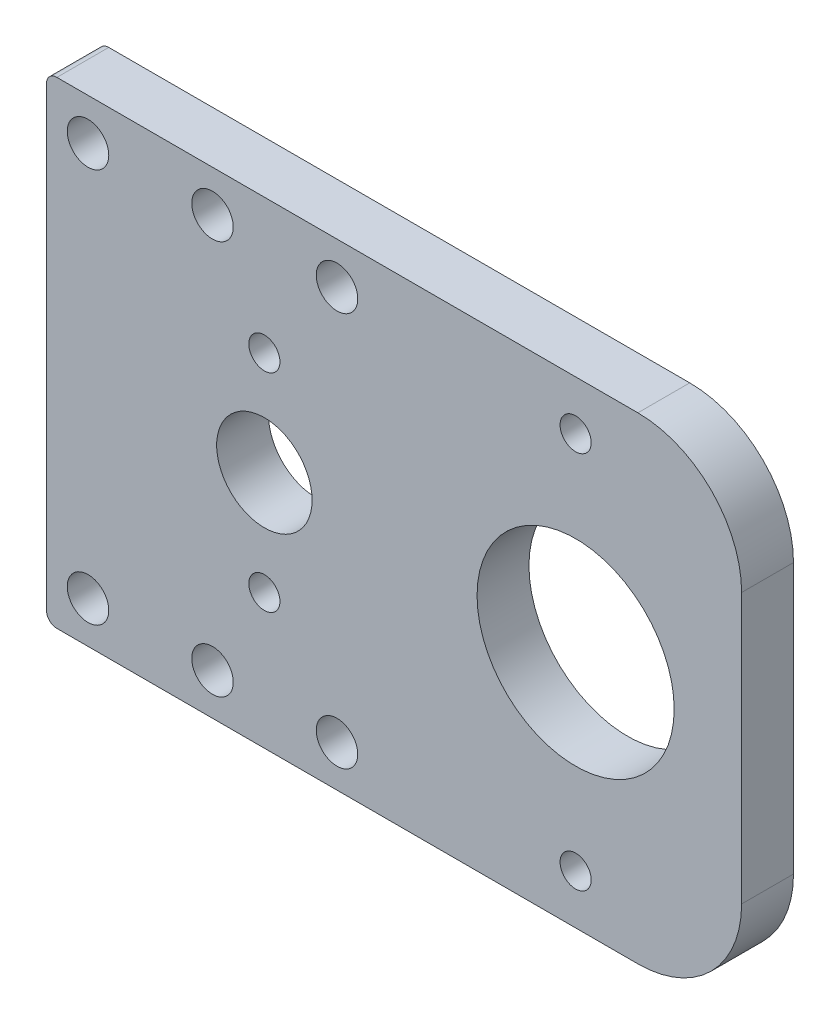
ISO-10303-21;
HEADER;
FILE_DESCRIPTION(('STEP AP214'),'2;1');
FILE_NAME('part.step','',(''),(''),'','','');
FILE_SCHEMA(('AUTOMOTIVE_DESIGN { 1 0 10303 214 1 1 1 1 }'));
ENDSEC;
DATA;
#1=APPLICATION_CONTEXT('core data for automotive mechanical design processes');
#2=APPLICATION_PROTOCOL_DEFINITION('international standard','automotive_design',2000,#1);
#3=PRODUCT_CONTEXT('',#1,'mechanical');
#4=PRODUCT('Part','Part','',(#3));
#5=PRODUCT_RELATED_PRODUCT_CATEGORY('part','',(#4));
#6=PRODUCT_DEFINITION_FORMATION('','',#4);
#7=PRODUCT_DEFINITION_CONTEXT('part definition',#1,'design');
#8=PRODUCT_DEFINITION('design','',#6,#7);
#9=PRODUCT_DEFINITION_SHAPE('','',#8);
#10=(LENGTH_UNIT() NAMED_UNIT(*) SI_UNIT(.MILLI.,.METRE.));
#11=(NAMED_UNIT(*) PLANE_ANGLE_UNIT() SI_UNIT($,.RADIAN.));
#12=(NAMED_UNIT(*) SI_UNIT($,.STERADIAN.) SOLID_ANGLE_UNIT());
#13=UNCERTAINTY_MEASURE_WITH_UNIT(LENGTH_MEASURE(1.E-05),#10,'distance_accuracy_value','');
#14=(GEOMETRIC_REPRESENTATION_CONTEXT(3) GLOBAL_UNCERTAINTY_ASSIGNED_CONTEXT((#13)) GLOBAL_UNIT_ASSIGNED_CONTEXT((#10,
#11,#12)) REPRESENTATION_CONTEXT('',''));
#15=CARTESIAN_POINT('',(0.,0.,0.));
#16=DIRECTION('',(0.,0.,1.));
#17=DIRECTION('',(1.,0.,0.));
#18=AXIS2_PLACEMENT_3D('',#15,#16,#17);
#19=CARTESIAN_POINT('',(0.,0.,5.));
#20=DIRECTION('',(0.,0.,1.));
#21=DIRECTION('',(1.,0.,0.));
#22=AXIS2_PLACEMENT_3D('',#19,#20,#21);
#23=PLANE('',#22);
#24=CARTESIAN_POINT('',(7.00000000000001,18.9999999999999,5.));
#25=DIRECTION('',(0.,0.,1.));
#26=DIRECTION('',(1.,0.,0.));
#27=AXIS2_PLACEMENT_3D('',#24,#25,#26);
#28=CIRCLE('',#27,2.);
#29=CARTESIAN_POINT('',(9.00000000000001,18.9999999999999,5.));
#30=VERTEX_POINT('',#29);
#31=EDGE_CURVE('E181',#30,#30,#28,.F.);
#32=ORIENTED_EDGE('',*,*,#31,.T.);
#33=EDGE_LOOP('',(#32));
#34=FACE_BOUND('',#33,.T.);
#35=CARTESIAN_POINT('',(-4.99999999999999,-18.9999999999999,5.));
#36=DIRECTION('',(0.,0.,1.));
#37=DIRECTION('',(1.,0.,0.));
#38=AXIS2_PLACEMENT_3D('',#35,#36,#37);
#39=CIRCLE('',#38,2.);
#40=CARTESIAN_POINT('',(-2.99999999999999,-18.9999999999999,5.));
#41=VERTEX_POINT('',#40);
#42=EDGE_CURVE('E174',#41,#41,#39,.F.);
#43=ORIENTED_EDGE('',*,*,#42,.T.);
#44=EDGE_LOOP('',(#43));
#45=FACE_BOUND('',#44,.T.);
#46=CARTESIAN_POINT('',(-17.,-18.9999999999999,5.));
#47=DIRECTION('',(0.,0.,1.));
#48=DIRECTION('',(1.,0.,0.));
#49=AXIS2_PLACEMENT_3D('',#46,#47,#48);
#50=CIRCLE('',#49,2.);
#51=CARTESIAN_POINT('',(-15.,-18.9999999999999,5.));
#52=VERTEX_POINT('',#51);
#53=EDGE_CURVE('E177',#52,#52,#50,.F.);
#54=ORIENTED_EDGE('',*,*,#53,.T.);
#55=EDGE_LOOP('',(#54));
#56=FACE_BOUND('',#55,.T.);
#57=CARTESIAN_POINT('',(30.,18.25,5.));
#58=DIRECTION('',(0.,0.,1.));
#59=DIRECTION('',(1.,0.,0.));
#60=AXIS2_PLACEMENT_3D('',#57,#58,#59);
#61=CIRCLE('',#60,1.5);
#62=CARTESIAN_POINT('',(31.5,18.25,5.));
#63=VERTEX_POINT('',#62);
#64=EDGE_CURVE('E192',#63,#63,#61,.T.);
#65=ORIENTED_EDGE('',*,*,#64,.F.);
#66=EDGE_LOOP('',(#65));
#67=FACE_BOUND('',#66,.T.);
#68=CARTESIAN_POINT('',(0.,-9.99999999999999,5.));
#69=DIRECTION('',(0.,0.,1.));
#70=DIRECTION('',(1.,0.,0.));
#71=AXIS2_PLACEMENT_3D('',#68,#69,#70);
#72=CIRCLE('',#71,1.5);
#73=CARTESIAN_POINT('',(1.50000000000002,-9.99999999999999,5.));
#74=VERTEX_POINT('',#73);
#75=EDGE_CURVE('E195',#74,#74,#72,.T.);
#76=ORIENTED_EDGE('',*,*,#75,.F.);
#77=EDGE_LOOP('',(#76));
#78=FACE_BOUND('',#77,.T.);
#79=CARTESIAN_POINT('',(30.,-18.25,5.));
#80=DIRECTION('',(0.,0.,1.));
#81=DIRECTION('',(1.,0.,0.));
#82=AXIS2_PLACEMENT_3D('',#79,#80,#81);
#83=CIRCLE('',#82,1.5);
#84=CARTESIAN_POINT('',(31.5,-18.25,5.));
#85=VERTEX_POINT('',#84);
#86=EDGE_CURVE('E199',#85,#85,#83,.F.);
#87=ORIENTED_EDGE('',*,*,#86,.T.);
#88=EDGE_LOOP('',(#87));
#89=FACE_BOUND('',#88,.T.);
#90=CARTESIAN_POINT('',(30.,0.,5.));
#91=DIRECTION('',(0.,0.,1.));
#92=DIRECTION('',(1.,0.,0.));
#93=AXIS2_PLACEMENT_3D('',#90,#91,#92);
#94=CIRCLE('',#93,9.5);
#95=CARTESIAN_POINT('',(39.5,0.,5.));
#96=VERTEX_POINT('',#95);
#97=EDGE_CURVE('E202',#96,#96,#94,.T.);
#98=ORIENTED_EDGE('',*,*,#97,.F.);
#99=EDGE_LOOP('',(#98));
#100=FACE_BOUND('',#99,.T.);
#101=CARTESIAN_POINT('',(0.,0.,5.));
#102=DIRECTION('',(0.,0.,1.));
#103=DIRECTION('',(1.,0.,0.));
#104=AXIS2_PLACEMENT_3D('',#101,#102,#103);
#105=CIRCLE('',#104,4.6);
#106=CARTESIAN_POINT('',(4.6,0.,5.));
#107=VERTEX_POINT('',#106);
#108=EDGE_CURVE('E208',#107,#107,#105,.T.);
#109=ORIENTED_EDGE('',*,*,#108,.F.);
#110=EDGE_LOOP('',(#109));
#111=FACE_BOUND('',#110,.T.);
#112=CARTESIAN_POINT('',(0.,9.99999999999999,5.));
#113=DIRECTION('',(0.,0.,1.));
#114=DIRECTION('',(1.,0.,0.));
#115=AXIS2_PLACEMENT_3D('',#112,#113,#114);
#116=CIRCLE('',#115,1.5);
#117=CARTESIAN_POINT('',(1.50000000000002,9.99999999999999,5.));
#118=VERTEX_POINT('',#117);
#119=EDGE_CURVE('E113',#118,#118,#116,.F.);
#120=ORIENTED_EDGE('',*,*,#119,.T.);
#121=EDGE_LOOP('',(#120));
#122=FACE_BOUND('',#121,.T.);
#123=CARTESIAN_POINT('',(7.00000000000001,-18.9999999999999,5.));
#124=DIRECTION('',(0.,0.,1.));
#125=DIRECTION('',(1.,0.,0.));
#126=AXIS2_PLACEMENT_3D('',#123,#124,#125);
#127=CIRCLE('',#126,2.);
#128=CARTESIAN_POINT('',(9.00000000000001,-18.9999999999999,5.));
#129=VERTEX_POINT('',#128);
#130=EDGE_CURVE('E178',#129,#129,#127,.T.);
#131=ORIENTED_EDGE('',*,*,#130,.F.);
#132=EDGE_LOOP('',(#131));
#133=FACE_BOUND('',#132,.T.);
#134=CARTESIAN_POINT('',(-4.99999999999999,18.9999999999999,5.));
#135=DIRECTION('',(0.,0.,1.));
#136=DIRECTION('',(1.,0.,0.));
#137=AXIS2_PLACEMENT_3D('',#134,#135,#136);
#138=CIRCLE('',#137,2.);
#139=CARTESIAN_POINT('',(-2.99999999999999,18.9999999999999,5.));
#140=VERTEX_POINT('',#139);
#141=EDGE_CURVE('E184',#140,#140,#138,.T.);
#142=ORIENTED_EDGE('',*,*,#141,.F.);
#143=EDGE_LOOP('',(#142));
#144=FACE_BOUND('',#143,.T.);
#145=CARTESIAN_POINT('',(-17.,18.9999999999999,5.));
#146=DIRECTION('',(0.,0.,1.));
#147=DIRECTION('',(1.,0.,0.));
#148=AXIS2_PLACEMENT_3D('',#145,#146,#147);
#149=CIRCLE('',#148,2.);
#150=CARTESIAN_POINT('',(-15.,18.9999999999999,5.));
#151=VERTEX_POINT('',#150);
#152=EDGE_CURVE('E170',#151,#151,#149,.T.);
#153=ORIENTED_EDGE('',*,*,#152,.F.);
#154=EDGE_LOOP('',(#153));
#155=FACE_BOUND('',#154,.T.);
#156=DIRECTION('',(-1.,0.,0.));
#157=VECTOR('',#156,1.);
#158=CARTESIAN_POINT('',(0.,23.,5.));
#159=LINE('',#158,#157);
#160=CARTESIAN_POINT('',(36.,23.,5.));
#161=VERTEX_POINT('',#160);
#162=CARTESIAN_POINT('',(-20.,23.,5.));
#163=VERTEX_POINT('',#162);
#164=EDGE_CURVE('E165',#161,#163,#159,.T.);
#165=ORIENTED_EDGE('',*,*,#164,.T.);
#166=CARTESIAN_POINT('',(-20.,22.,5.));
#167=DIRECTION('',(0.,0.,1.));
#168=DIRECTION('',(1.,0.,0.));
#169=AXIS2_PLACEMENT_3D('',#166,#167,#168);
#170=CIRCLE('',#169,1.);
#171=CARTESIAN_POINT('',(-21.,22.,5.));
#172=VERTEX_POINT('',#171);
#173=EDGE_CURVE('E139',#163,#172,#170,.T.);
#174=ORIENTED_EDGE('',*,*,#173,.T.);
#175=DIRECTION('',(0.,-1.,0.));
#176=VECTOR('',#175,1.);
#177=CARTESIAN_POINT('',(-21.,0.,5.));
#178=LINE('',#177,#176);
#179=CARTESIAN_POINT('',(-21.,-22.,5.));
#180=VERTEX_POINT('',#179);
#181=EDGE_CURVE('E120',#172,#180,#178,.T.);
#182=ORIENTED_EDGE('',*,*,#181,.T.);
#183=CARTESIAN_POINT('',(-20.,-22.,5.));
#184=DIRECTION('',(0.,0.,1.));
#185=DIRECTION('',(1.,0.,0.));
#186=AXIS2_PLACEMENT_3D('',#183,#184,#185);
#187=CIRCLE('',#186,1.);
#188=CARTESIAN_POINT('',(-20.,-23.,5.));
#189=VERTEX_POINT('',#188);
#190=EDGE_CURVE('E137',#180,#189,#187,.T.);
#191=ORIENTED_EDGE('',*,*,#190,.T.);
#192=DIRECTION('',(-1.,0.,0.));
#193=VECTOR('',#192,1.);
#194=CARTESIAN_POINT('',(0.,-23.,5.));
#195=LINE('',#194,#193);
#196=CARTESIAN_POINT('',(36.,-23.,5.));
#197=VERTEX_POINT('',#196);
#198=EDGE_CURVE('E206',#197,#189,#195,.T.);
#199=ORIENTED_EDGE('',*,*,#198,.F.);
#200=CARTESIAN_POINT('',(36.,-13.,5.));
#201=DIRECTION('',(0.,0.,1.));
#202=DIRECTION('',(1.,0.,0.));
#203=AXIS2_PLACEMENT_3D('',#200,#201,#202);
#204=CIRCLE('',#203,10.);
#205=CARTESIAN_POINT('',(46.,-13.,5.));
#206=VERTEX_POINT('',#205);
#207=EDGE_CURVE('E248',#197,#206,#204,.T.);
#208=ORIENTED_EDGE('',*,*,#207,.T.);
#209=DIRECTION('',(0.,-1.,0.));
#210=VECTOR('',#209,1.);
#211=CARTESIAN_POINT('',(46.,0.,5.));
#212=LINE('',#211,#210);
#213=CARTESIAN_POINT('',(46.,13.,5.));
#214=VERTEX_POINT('',#213);
#215=EDGE_CURVE('E109',#214,#206,#212,.T.);
#216=ORIENTED_EDGE('',*,*,#215,.F.);
#217=CARTESIAN_POINT('',(36.,13.,5.));
#218=DIRECTION('',(0.,0.,1.));
#219=DIRECTION('',(1.,0.,0.));
#220=AXIS2_PLACEMENT_3D('',#217,#218,#219);
#221=CIRCLE('',#220,10.);
#222=EDGE_CURVE('E129',#214,#161,#221,.T.);
#223=ORIENTED_EDGE('',*,*,#222,.T.);
#224=EDGE_LOOP('',(#165,#174,#182,#191,#199,#208,#216,#223));
#225=FACE_BOUND('',#224,.T.);
#226=ADVANCED_FACE('F35',(#34,#45,#56,#67,#78,#89,#100,#111,#122,#133,#144,#155,#225),#23,.T.);
#227=CARTESIAN_POINT('',(0.,0.,0.));
#228=DIRECTION('',(0.,0.,1.));
#229=DIRECTION('',(1.,0.,0.));
#230=AXIS2_PLACEMENT_3D('',#227,#228,#229);
#231=PLANE('',#230);
#232=CARTESIAN_POINT('',(-17.,18.9999999999999,0.));
#233=DIRECTION('',(0.,0.,1.));
#234=DIRECTION('',(1.,0.,0.));
#235=AXIS2_PLACEMENT_3D('',#232,#233,#234);
#236=CIRCLE('',#235,2.);
#237=CARTESIAN_POINT('',(-15.,18.9999999999999,0.));
#238=VERTEX_POINT('',#237);
#239=EDGE_CURVE('E217',#238,#238,#236,.T.);
#240=ORIENTED_EDGE('',*,*,#239,.T.);
#241=EDGE_LOOP('',(#240));
#242=FACE_BOUND('',#241,.T.);
#243=CARTESIAN_POINT('',(7.00000000000001,-18.9999999999999,0.));
#244=DIRECTION('',(0.,0.,1.));
#245=DIRECTION('',(1.,0.,0.));
#246=AXIS2_PLACEMENT_3D('',#243,#244,#245);
#247=CIRCLE('',#246,2.);
#248=CARTESIAN_POINT('',(9.00000000000001,-18.9999999999999,0.));
#249=VERTEX_POINT('',#248);
#250=EDGE_CURVE('E236',#249,#249,#247,.T.);
#251=ORIENTED_EDGE('',*,*,#250,.T.);
#252=EDGE_LOOP('',(#251));
#253=FACE_BOUND('',#252,.T.);
#254=CARTESIAN_POINT('',(-4.99999999999999,-18.9999999999999,0.));
#255=DIRECTION('',(0.,0.,1.));
#256=DIRECTION('',(1.,0.,0.));
#257=AXIS2_PLACEMENT_3D('',#254,#255,#256);
#258=CIRCLE('',#257,2.);
#259=CARTESIAN_POINT('',(-2.99999999999999,-18.9999999999999,0.));
#260=VERTEX_POINT('',#259);
#261=EDGE_CURVE('E233',#260,#260,#258,.F.);
#262=ORIENTED_EDGE('',*,*,#261,.F.);
#263=EDGE_LOOP('',(#262));
#264=FACE_BOUND('',#263,.T.);
#265=CARTESIAN_POINT('',(-17.,-18.9999999999999,0.));
#266=DIRECTION('',(0.,0.,1.));
#267=DIRECTION('',(1.,0.,0.));
#268=AXIS2_PLACEMENT_3D('',#265,#266,#267);
#269=CIRCLE('',#268,2.);
#270=CARTESIAN_POINT('',(-15.,-18.9999999999999,0.));
#271=VERTEX_POINT('',#270);
#272=EDGE_CURVE('E191',#271,#271,#269,.F.);
#273=ORIENTED_EDGE('',*,*,#272,.F.);
#274=EDGE_LOOP('',(#273));
#275=FACE_BOUND('',#274,.T.);
#276=CARTESIAN_POINT('',(30.,18.25,0.));
#277=DIRECTION('',(0.,0.,1.));
#278=DIRECTION('',(1.,0.,0.));
#279=AXIS2_PLACEMENT_3D('',#276,#277,#278);
#280=CIRCLE('',#279,1.5);
#281=CARTESIAN_POINT('',(31.5,18.25,0.));
#282=VERTEX_POINT('',#281);
#283=EDGE_CURVE('E213',#282,#282,#280,.T.);
#284=ORIENTED_EDGE('',*,*,#283,.T.);
#285=EDGE_LOOP('',(#284));
#286=FACE_BOUND('',#285,.T.);
#287=CARTESIAN_POINT('',(0.,-9.99999999999999,0.));
#288=DIRECTION('',(0.,0.,1.));
#289=DIRECTION('',(1.,0.,0.));
#290=AXIS2_PLACEMENT_3D('',#287,#288,#289);
#291=CIRCLE('',#290,1.5);
#292=CARTESIAN_POINT('',(1.50000000000002,-9.99999999999999,0.));
#293=VERTEX_POINT('',#292);
#294=EDGE_CURVE('E216',#293,#293,#291,.T.);
#295=ORIENTED_EDGE('',*,*,#294,.T.);
#296=EDGE_LOOP('',(#295));
#297=FACE_BOUND('',#296,.T.);
#298=CARTESIAN_POINT('',(30.,-18.25,0.));
#299=DIRECTION('',(0.,0.,1.));
#300=DIRECTION('',(1.,0.,0.));
#301=AXIS2_PLACEMENT_3D('',#298,#299,#300);
#302=CIRCLE('',#301,1.5);
#303=CARTESIAN_POINT('',(31.5,-18.25,0.));
#304=VERTEX_POINT('',#303);
#305=EDGE_CURVE('E220',#304,#304,#302,.F.);
#306=ORIENTED_EDGE('',*,*,#305,.F.);
#307=EDGE_LOOP('',(#306));
#308=FACE_BOUND('',#307,.T.);
#309=CARTESIAN_POINT('',(30.,0.,0.));
#310=DIRECTION('',(0.,0.,1.));
#311=DIRECTION('',(1.,0.,0.));
#312=AXIS2_PLACEMENT_3D('',#309,#310,#311);
#313=CIRCLE('',#312,9.5);
#314=CARTESIAN_POINT('',(39.5,0.,0.));
#315=VERTEX_POINT('',#314);
#316=EDGE_CURVE('E159',#315,#315,#313,.T.);
#317=ORIENTED_EDGE('',*,*,#316,.T.);
#318=EDGE_LOOP('',(#317));
#319=FACE_BOUND('',#318,.T.);
#320=CARTESIAN_POINT('',(0.,0.,0.));
#321=DIRECTION('',(0.,0.,1.));
#322=DIRECTION('',(1.,0.,0.));
#323=AXIS2_PLACEMENT_3D('',#320,#321,#322);
#324=CIRCLE('',#323,4.6);
#325=CARTESIAN_POINT('',(4.6,0.,0.));
#326=VERTEX_POINT('',#325);
#327=EDGE_CURVE('E226',#326,#326,#324,.T.);
#328=ORIENTED_EDGE('',*,*,#327,.T.);
#329=EDGE_LOOP('',(#328));
#330=FACE_BOUND('',#329,.T.);
#331=CARTESIAN_POINT('',(0.,9.99999999999999,0.));
#332=DIRECTION('',(0.,0.,1.));
#333=DIRECTION('',(1.,0.,0.));
#334=AXIS2_PLACEMENT_3D('',#331,#332,#333);
#335=CIRCLE('',#334,1.5);
#336=CARTESIAN_POINT('',(1.50000000000002,9.99999999999999,0.));
#337=VERTEX_POINT('',#336);
#338=EDGE_CURVE('E196',#337,#337,#335,.F.);
#339=ORIENTED_EDGE('',*,*,#338,.F.);
#340=EDGE_LOOP('',(#339));
#341=FACE_BOUND('',#340,.T.);
#342=CARTESIAN_POINT('',(7.00000000000001,18.9999999999999,0.));
#343=DIRECTION('',(0.,0.,1.));
#344=DIRECTION('',(1.,0.,0.));
#345=AXIS2_PLACEMENT_3D('',#342,#343,#344);
#346=CIRCLE('',#345,2.);
#347=CARTESIAN_POINT('',(9.00000000000001,18.9999999999999,0.));
#348=VERTEX_POINT('',#347);
#349=EDGE_CURVE('E239',#348,#348,#346,.F.);
#350=ORIENTED_EDGE('',*,*,#349,.F.);
#351=EDGE_LOOP('',(#350));
#352=FACE_BOUND('',#351,.T.);
#353=CARTESIAN_POINT('',(-4.99999999999999,18.9999999999999,0.));
#354=DIRECTION('',(0.,0.,1.));
#355=DIRECTION('',(1.,0.,0.));
#356=AXIS2_PLACEMENT_3D('',#353,#354,#355);
#357=CIRCLE('',#356,2.);
#358=CARTESIAN_POINT('',(-2.99999999999999,18.9999999999999,0.));
#359=VERTEX_POINT('',#358);
#360=EDGE_CURVE('E242',#359,#359,#357,.T.);
#361=ORIENTED_EDGE('',*,*,#360,.T.);
#362=EDGE_LOOP('',(#361));
#363=FACE_BOUND('',#362,.T.);
#364=DIRECTION('',(0.,-1.,0.));
#365=VECTOR('',#364,1.);
#366=CARTESIAN_POINT('',(-21.,0.,0.));
#367=LINE('',#366,#365);
#368=CARTESIAN_POINT('',(-21.,22.,0.));
#369=VERTEX_POINT('',#368);
#370=CARTESIAN_POINT('',(-21.,-22.,0.));
#371=VERTEX_POINT('',#370);
#372=EDGE_CURVE('E149',#369,#371,#367,.T.);
#373=ORIENTED_EDGE('',*,*,#372,.F.);
#374=CARTESIAN_POINT('',(-20.,22.,0.));
#375=DIRECTION('',(0.,0.,1.));
#376=DIRECTION('',(1.,0.,0.));
#377=AXIS2_PLACEMENT_3D('',#374,#375,#376);
#378=CIRCLE('',#377,1.);
#379=CARTESIAN_POINT('',(-20.,23.,0.));
#380=VERTEX_POINT('',#379);
#381=EDGE_CURVE('E43',#369,#380,#378,.F.);
#382=ORIENTED_EDGE('',*,*,#381,.T.);
#383=DIRECTION('',(-1.,0.,0.));
#384=VECTOR('',#383,1.);
#385=CARTESIAN_POINT('',(0.,23.,0.));
#386=LINE('',#385,#384);
#387=CARTESIAN_POINT('',(36.,23.,0.));
#388=VERTEX_POINT('',#387);
#389=EDGE_CURVE('E148',#388,#380,#386,.T.);
#390=ORIENTED_EDGE('',*,*,#389,.F.);
#391=CARTESIAN_POINT('',(36.,13.,0.));
#392=DIRECTION('',(0.,0.,1.));
#393=DIRECTION('',(1.,0.,0.));
#394=AXIS2_PLACEMENT_3D('',#391,#392,#393);
#395=CIRCLE('',#394,10.);
#396=CARTESIAN_POINT('',(46.,13.,0.));
#397=VERTEX_POINT('',#396);
#398=EDGE_CURVE('E119',#388,#397,#395,.F.);
#399=ORIENTED_EDGE('',*,*,#398,.T.);
#400=DIRECTION('',(0.,1.,0.));
#401=VECTOR('',#400,1.);
#402=CARTESIAN_POINT('',(46.,0.,0.));
#403=LINE('',#402,#401);
#404=CARTESIAN_POINT('',(46.,-13.,0.));
#405=VERTEX_POINT('',#404);
#406=EDGE_CURVE('E106',#405,#397,#403,.T.);
#407=ORIENTED_EDGE('',*,*,#406,.F.);
#408=CARTESIAN_POINT('',(36.,-13.,0.));
#409=DIRECTION('',(0.,0.,1.));
#410=DIRECTION('',(1.,0.,0.));
#411=AXIS2_PLACEMENT_3D('',#408,#409,#410);
#412=CIRCLE('',#411,10.);
#413=CARTESIAN_POINT('',(36.,-23.,0.));
#414=VERTEX_POINT('',#413);
#415=EDGE_CURVE('E116',#405,#414,#412,.F.);
#416=ORIENTED_EDGE('',*,*,#415,.T.);
#417=DIRECTION('',(-1.,0.,0.));
#418=VECTOR('',#417,1.);
#419=CARTESIAN_POINT('',(0.,-23.,0.));
#420=LINE('',#419,#418);
#421=CARTESIAN_POINT('',(-20.,-23.,0.));
#422=VERTEX_POINT('',#421);
#423=EDGE_CURVE('E158',#414,#422,#420,.T.);
#424=ORIENTED_EDGE('',*,*,#423,.T.);
#425=CARTESIAN_POINT('',(-20.,-22.,0.));
#426=DIRECTION('',(0.,0.,1.));
#427=DIRECTION('',(1.,0.,0.));
#428=AXIS2_PLACEMENT_3D('',#425,#426,#427);
#429=CIRCLE('',#428,1.);
#430=EDGE_CURVE('E55',#422,#371,#429,.F.);
#431=ORIENTED_EDGE('',*,*,#430,.T.);
#432=EDGE_LOOP('',(#373,#382,#390,#399,#407,#416,#424,#431));
#433=FACE_BOUND('',#432,.T.);
#434=ADVANCED_FACE('F115',(#242,#253,#264,#275,#286,#297,#308,#319,#330,#341,#352,#363,#433),
#231,.F.);
#435=CARTESIAN_POINT('',(0.,23.,5.));
#436=DIRECTION('',(0.,-1.,0.));
#437=DIRECTION('',(1.,0.,0.));
#438=AXIS2_PLACEMENT_3D('',#435,#436,#437);
#439=PLANE('',#438);
#440=ORIENTED_EDGE('',*,*,#389,.T.);
#441=DIRECTION('',(0.,0.,1.));
#442=VECTOR('',#441,1.);
#443=CARTESIAN_POINT('',(-20.,23.,5.));
#444=LINE('',#443,#442);
#445=EDGE_CURVE('E134',#380,#163,#444,.T.);
#446=ORIENTED_EDGE('',*,*,#445,.T.);
#447=ORIENTED_EDGE('',*,*,#164,.F.);
#448=DIRECTION('',(0.,0.,1.));
#449=VECTOR('',#448,1.);
#450=CARTESIAN_POINT('',(36.,23.,5.));
#451=LINE('',#450,#449);
#452=EDGE_CURVE('E126',#161,#388,#451,.F.);
#453=ORIENTED_EDGE('',*,*,#452,.T.);
#454=EDGE_LOOP('',(#440,#446,#447,#453));
#455=FACE_BOUND('',#454,.T.);
#456=ADVANCED_FACE('F154',(#455),#439,.F.);
#457=CARTESIAN_POINT('',(0.,-23.,5.));
#458=DIRECTION('',(0.,-1.,0.));
#459=DIRECTION('',(1.,0.,0.));
#460=AXIS2_PLACEMENT_3D('',#457,#458,#459);
#461=PLANE('',#460);
#462=ORIENTED_EDGE('',*,*,#198,.T.);
#463=DIRECTION('',(0.,0.,1.));
#464=VECTOR('',#463,1.);
#465=CARTESIAN_POINT('',(-20.,-23.,5.));
#466=LINE('',#465,#464);
#467=EDGE_CURVE('E11',#189,#422,#466,.F.);
#468=ORIENTED_EDGE('',*,*,#467,.T.);
#469=ORIENTED_EDGE('',*,*,#423,.F.);
#470=DIRECTION('',(0.,0.,1.));
#471=VECTOR('',#470,1.);
#472=CARTESIAN_POINT('',(36.,-23.,5.));
#473=LINE('',#472,#471);
#474=EDGE_CURVE('E125',#414,#197,#473,.T.);
#475=ORIENTED_EDGE('',*,*,#474,.T.);
#476=EDGE_LOOP('',(#462,#468,#469,#475));
#477=FACE_BOUND('',#476,.T.);
#478=ADVANCED_FACE('F282',(#477),#461,.T.);
#479=CARTESIAN_POINT('',(0.,0.,5.));
#480=DIRECTION('',(0.,0.,-1.));
#481=DIRECTION('',(-1.,0.,0.));
#482=AXIS2_PLACEMENT_3D('',#479,#480,#481);
#483=CYLINDRICAL_SURFACE('',#482,4.6);
#484=ORIENTED_EDGE('',*,*,#108,.T.);
#485=EDGE_LOOP('',(#484));
#486=FACE_BOUND('',#485,.T.);
#487=ORIENTED_EDGE('',*,*,#327,.F.);
#488=EDGE_LOOP('',(#487));
#489=FACE_BOUND('',#488,.T.);
#490=ADVANCED_FACE('F278',(#486,#489),#483,.F.);
#491=CARTESIAN_POINT('',(30.,0.,5.));
#492=DIRECTION('',(0.,0.,-1.));
#493=DIRECTION('',(-1.,0.,0.));
#494=AXIS2_PLACEMENT_3D('',#491,#492,#493);
#495=CYLINDRICAL_SURFACE('',#494,9.5);
#496=ORIENTED_EDGE('',*,*,#97,.T.);
#497=EDGE_LOOP('',(#496));
#498=FACE_BOUND('',#497,.T.);
#499=ORIENTED_EDGE('',*,*,#316,.F.);
#500=EDGE_LOOP('',(#499));
#501=FACE_BOUND('',#500,.T.);
#502=ADVANCED_FACE('F281',(#498,#501),#495,.F.);
#503=CARTESIAN_POINT('',(30.,-18.25,5.));
#504=DIRECTION('',(0.,0.,-1.));
#505=DIRECTION('',(-1.,0.,0.));
#506=AXIS2_PLACEMENT_3D('',#503,#504,#505);
#507=CYLINDRICAL_SURFACE('',#506,1.5);
#508=ORIENTED_EDGE('',*,*,#86,.F.);
#509=EDGE_LOOP('',(#508));
#510=FACE_BOUND('',#509,.T.);
#511=ORIENTED_EDGE('',*,*,#305,.T.);
#512=EDGE_LOOP('',(#511));
#513=FACE_BOUND('',#512,.T.);
#514=ADVANCED_FACE('F290',(#510,#513),#507,.F.);
#515=CARTESIAN_POINT('',(0.,-9.99999999999999,5.));
#516=DIRECTION('',(0.,0.,-1.));
#517=DIRECTION('',(-1.,0.,0.));
#518=AXIS2_PLACEMENT_3D('',#515,#516,#517);
#519=CYLINDRICAL_SURFACE('',#518,1.5);
#520=ORIENTED_EDGE('',*,*,#75,.T.);
#521=EDGE_LOOP('',(#520));
#522=FACE_BOUND('',#521,.T.);
#523=ORIENTED_EDGE('',*,*,#294,.F.);
#524=EDGE_LOOP('',(#523));
#525=FACE_BOUND('',#524,.T.);
#526=ADVANCED_FACE('F294',(#522,#525),#519,.F.);
#527=CARTESIAN_POINT('',(30.,18.25,5.));
#528=DIRECTION('',(0.,0.,-1.));
#529=DIRECTION('',(-1.,0.,0.));
#530=AXIS2_PLACEMENT_3D('',#527,#528,#529);
#531=CYLINDRICAL_SURFACE('',#530,1.5);
#532=ORIENTED_EDGE('',*,*,#64,.T.);
#533=EDGE_LOOP('',(#532));
#534=FACE_BOUND('',#533,.T.);
#535=ORIENTED_EDGE('',*,*,#283,.F.);
#536=EDGE_LOOP('',(#535));
#537=FACE_BOUND('',#536,.T.);
#538=ADVANCED_FACE('F276',(#534,#537),#531,.F.);
#539=CARTESIAN_POINT('',(0.,9.99999999999999,5.));
#540=DIRECTION('',(0.,0.,-1.));
#541=DIRECTION('',(-1.,0.,0.));
#542=AXIS2_PLACEMENT_3D('',#539,#540,#541);
#543=CYLINDRICAL_SURFACE('',#542,1.5);
#544=ORIENTED_EDGE('',*,*,#119,.F.);
#545=EDGE_LOOP('',(#544));
#546=FACE_BOUND('',#545,.T.);
#547=ORIENTED_EDGE('',*,*,#338,.T.);
#548=EDGE_LOOP('',(#547));
#549=FACE_BOUND('',#548,.T.);
#550=ADVANCED_FACE('F273',(#546,#549),#543,.F.);
#551=CARTESIAN_POINT('',(-17.,-18.9999999999999,-5.));
#552=DIRECTION('',(0.,0.,1.));
#553=DIRECTION('',(1.,0.,0.));
#554=AXIS2_PLACEMENT_3D('',#551,#552,#553);
#555=CYLINDRICAL_SURFACE('',#554,2.);
#556=ORIENTED_EDGE('',*,*,#53,.F.);
#557=EDGE_LOOP('',(#556));
#558=FACE_BOUND('',#557,.T.);
#559=ORIENTED_EDGE('',*,*,#272,.T.);
#560=EDGE_LOOP('',(#559));
#561=FACE_BOUND('',#560,.T.);
#562=ADVANCED_FACE('F270',(#558,#561),#555,.F.);
#563=CARTESIAN_POINT('',(-4.99999999999999,-18.9999999999999,-5.));
#564=DIRECTION('',(0.,0.,1.));
#565=DIRECTION('',(1.,0.,0.));
#566=AXIS2_PLACEMENT_3D('',#563,#564,#565);
#567=CYLINDRICAL_SURFACE('',#566,2.);
#568=ORIENTED_EDGE('',*,*,#42,.F.);
#569=EDGE_LOOP('',(#568));
#570=FACE_BOUND('',#569,.T.);
#571=ORIENTED_EDGE('',*,*,#261,.T.);
#572=EDGE_LOOP('',(#571));
#573=FACE_BOUND('',#572,.T.);
#574=ADVANCED_FACE('F338',(#570,#573),#567,.F.);
#575=CARTESIAN_POINT('',(7.00000000000001,-18.9999999999999,-5.));
#576=DIRECTION('',(0.,0.,1.));
#577=DIRECTION('',(1.,0.,0.));
#578=AXIS2_PLACEMENT_3D('',#575,#576,#577);
#579=CYLINDRICAL_SURFACE('',#578,2.);
#580=ORIENTED_EDGE('',*,*,#130,.T.);
#581=EDGE_LOOP('',(#580));
#582=FACE_BOUND('',#581,.T.);
#583=ORIENTED_EDGE('',*,*,#250,.F.);
#584=EDGE_LOOP('',(#583));
#585=FACE_BOUND('',#584,.T.);
#586=ADVANCED_FACE('F332',(#582,#585),#579,.F.);
#587=CARTESIAN_POINT('',(7.00000000000001,18.9999999999999,-5.));
#588=DIRECTION('',(0.,0.,1.));
#589=DIRECTION('',(1.,0.,0.));
#590=AXIS2_PLACEMENT_3D('',#587,#588,#589);
#591=CYLINDRICAL_SURFACE('',#590,2.);
#592=ORIENTED_EDGE('',*,*,#31,.F.);
#593=EDGE_LOOP('',(#592));
#594=FACE_BOUND('',#593,.T.);
#595=ORIENTED_EDGE('',*,*,#349,.T.);
#596=EDGE_LOOP('',(#595));
#597=FACE_BOUND('',#596,.T.);
#598=ADVANCED_FACE('F324',(#594,#597),#591,.F.);
#599=CARTESIAN_POINT('',(-4.99999999999999,18.9999999999999,-5.));
#600=DIRECTION('',(0.,0.,1.));
#601=DIRECTION('',(1.,0.,0.));
#602=AXIS2_PLACEMENT_3D('',#599,#600,#601);
#603=CYLINDRICAL_SURFACE('',#602,2.);
#604=ORIENTED_EDGE('',*,*,#141,.T.);
#605=EDGE_LOOP('',(#604));
#606=FACE_BOUND('',#605,.T.);
#607=ORIENTED_EDGE('',*,*,#360,.F.);
#608=EDGE_LOOP('',(#607));
#609=FACE_BOUND('',#608,.T.);
#610=ADVANCED_FACE('F321',(#606,#609),#603,.F.);
#611=CARTESIAN_POINT('',(-17.,18.9999999999999,-5.));
#612=DIRECTION('',(0.,0.,1.));
#613=DIRECTION('',(1.,0.,0.));
#614=AXIS2_PLACEMENT_3D('',#611,#612,#613);
#615=CYLINDRICAL_SURFACE('',#614,2.);
#616=ORIENTED_EDGE('',*,*,#152,.T.);
#617=EDGE_LOOP('',(#616));
#618=FACE_BOUND('',#617,.T.);
#619=ORIENTED_EDGE('',*,*,#239,.F.);
#620=EDGE_LOOP('',(#619));
#621=FACE_BOUND('',#620,.T.);
#622=ADVANCED_FACE('F323',(#618,#621),#615,.F.);
#623=CARTESIAN_POINT('',(-21.,0.,0.));
#624=DIRECTION('',(-1.,0.,0.));
#625=DIRECTION('',(0.,-1.,0.));
#626=AXIS2_PLACEMENT_3D('',#623,#624,#625);
#627=PLANE('',#626);
#628=ORIENTED_EDGE('',*,*,#181,.F.);
#629=DIRECTION('',(0.,0.,1.));
#630=VECTOR('',#629,1.);
#631=CARTESIAN_POINT('',(-21.,22.,0.));
#632=LINE('',#631,#630);
#633=EDGE_CURVE('E144',#172,#369,#632,.F.);
#634=ORIENTED_EDGE('',*,*,#633,.T.);
#635=ORIENTED_EDGE('',*,*,#372,.T.);
#636=DIRECTION('',(0.,0.,1.));
#637=VECTOR('',#636,1.);
#638=CARTESIAN_POINT('',(-21.,-22.,0.));
#639=LINE('',#638,#637);
#640=EDGE_CURVE('E141',#371,#180,#639,.T.);
#641=ORIENTED_EDGE('',*,*,#640,.T.);
#642=EDGE_LOOP('',(#628,#634,#635,#641));
#643=FACE_BOUND('',#642,.T.);
#644=ADVANCED_FACE('F167',(#643),#627,.T.);
#645=CARTESIAN_POINT('',(46.,0.,-46.3896540189728));
#646=DIRECTION('',(-1.,0.,0.));
#647=DIRECTION('',(0.,0.,1.));
#648=AXIS2_PLACEMENT_3D('',#645,#646,#647);
#649=PLANE('',#648);
#650=ORIENTED_EDGE('',*,*,#406,.T.);
#651=DIRECTION('',(0.,0.,1.));
#652=VECTOR('',#651,1.);
#653=CARTESIAN_POINT('',(46.,13.,-46.3896540189728));
#654=LINE('',#653,#652);
#655=EDGE_CURVE('E112',#397,#214,#654,.T.);
#656=ORIENTED_EDGE('',*,*,#655,.T.);
#657=ORIENTED_EDGE('',*,*,#215,.T.);
#658=DIRECTION('',(0.,0.,1.));
#659=VECTOR('',#658,1.);
#660=CARTESIAN_POINT('',(46.,-13.,0.));
#661=LINE('',#660,#659);
#662=EDGE_CURVE('E102',#206,#405,#661,.F.);
#663=ORIENTED_EDGE('',*,*,#662,.T.);
#664=EDGE_LOOP('',(#650,#656,#657,#663));
#665=FACE_BOUND('',#664,.T.);
#666=ADVANCED_FACE('F104',(#665),#649,.F.);
#667=CARTESIAN_POINT('',(36.,13.,-46.3896540189728));
#668=DIRECTION('',(0.,0.,1.));
#669=DIRECTION('',(1.,0.,0.));
#670=AXIS2_PLACEMENT_3D('',#667,#668,#669);
#671=CYLINDRICAL_SURFACE('',#670,10.);
#672=ORIENTED_EDGE('',*,*,#398,.F.);
#673=ORIENTED_EDGE('',*,*,#452,.F.);
#674=ORIENTED_EDGE('',*,*,#222,.F.);
#675=ORIENTED_EDGE('',*,*,#655,.F.);
#676=EDGE_LOOP('',(#672,#673,#674,#675));
#677=FACE_BOUND('',#676,.T.);
#678=ADVANCED_FACE('F250',(#677),#671,.T.);
#679=CARTESIAN_POINT('',(36.,-13.,5.));
#680=DIRECTION('',(0.,0.,-1.));
#681=DIRECTION('',(-1.,0.,0.));
#682=AXIS2_PLACEMENT_3D('',#679,#680,#681);
#683=CYLINDRICAL_SURFACE('',#682,10.);
#684=ORIENTED_EDGE('',*,*,#415,.F.);
#685=ORIENTED_EDGE('',*,*,#662,.F.);
#686=ORIENTED_EDGE('',*,*,#207,.F.);
#687=ORIENTED_EDGE('',*,*,#474,.F.);
#688=EDGE_LOOP('',(#684,#685,#686,#687));
#689=FACE_BOUND('',#688,.T.);
#690=ADVANCED_FACE('F123',(#689),#683,.T.);
#691=CARTESIAN_POINT('',(-20.,22.,5.));
#692=DIRECTION('',(0.,0.,-1.));
#693=DIRECTION('',(-1.,0.,0.));
#694=AXIS2_PLACEMENT_3D('',#691,#692,#693);
#695=CYLINDRICAL_SURFACE('',#694,1.);
#696=ORIENTED_EDGE('',*,*,#381,.F.);
#697=ORIENTED_EDGE('',*,*,#633,.F.);
#698=ORIENTED_EDGE('',*,*,#173,.F.);
#699=ORIENTED_EDGE('',*,*,#445,.F.);
#700=EDGE_LOOP('',(#696,#697,#698,#699));
#701=FACE_BOUND('',#700,.T.);
#702=ADVANCED_FACE('F161',(#701),#695,.T.);
#703=CARTESIAN_POINT('',(-20.,-22.,0.));
#704=DIRECTION('',(0.,0.,1.));
#705=DIRECTION('',(1.,0.,0.));
#706=AXIS2_PLACEMENT_3D('',#703,#704,#705);
#707=CYLINDRICAL_SURFACE('',#706,1.);
#708=ORIENTED_EDGE('',*,*,#430,.F.);
#709=ORIENTED_EDGE('',*,*,#467,.F.);
#710=ORIENTED_EDGE('',*,*,#190,.F.);
#711=ORIENTED_EDGE('',*,*,#640,.F.);
#712=EDGE_LOOP('',(#708,#709,#710,#711));
#713=FACE_BOUND('',#712,.T.);
#714=ADVANCED_FACE('F37',(#713),#707,.T.);
#715=CLOSED_SHELL('',(#226,#434,#456,#478,#490,#502,#514,#526,#538,#550,#562,#574,#586,#598,
#610,#622,#644,#666,#678,#690,#702,#714));
#716=MANIFOLD_SOLID_BREP('B2',#715);
#717=ADVANCED_BREP_SHAPE_REPRESENTATION('',(#18,#716),#14);
#718=SHAPE_DEFINITION_REPRESENTATION(#9,#717);
ENDSEC;
END-ISO-10303-21;
